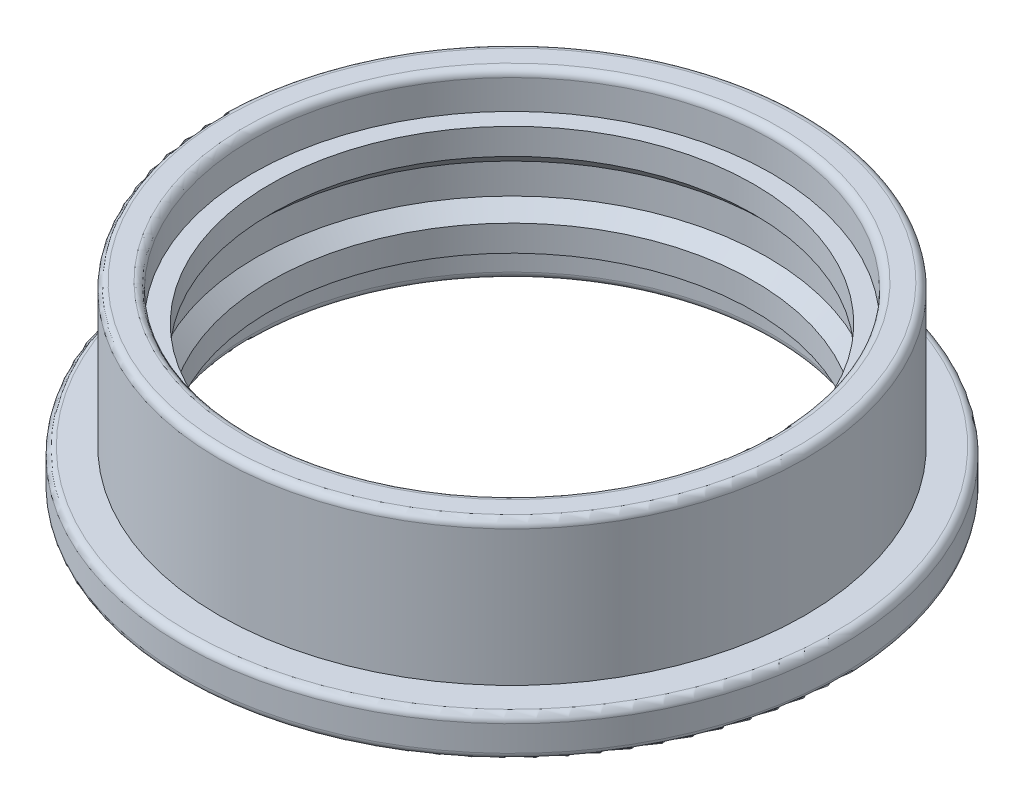
ISO-10303-21;
HEADER;
FILE_DESCRIPTION(('STEP AP214'),'2;1');
FILE_NAME('part.step','',(''),(''),'','','');
FILE_SCHEMA(('AUTOMOTIVE_DESIGN { 1 0 10303 214 1 1 1 1 }'));
ENDSEC;
DATA;
#1=APPLICATION_CONTEXT('core data for automotive mechanical design processes');
#2=APPLICATION_PROTOCOL_DEFINITION('international standard','automotive_design',2000,#1);
#3=PRODUCT_CONTEXT('',#1,'mechanical');
#4=PRODUCT('Part','Part','',(#3));
#5=PRODUCT_RELATED_PRODUCT_CATEGORY('part','',(#4));
#6=PRODUCT_DEFINITION_FORMATION('','',#4);
#7=PRODUCT_DEFINITION_CONTEXT('part definition',#1,'design');
#8=PRODUCT_DEFINITION('design','',#6,#7);
#9=PRODUCT_DEFINITION_SHAPE('','',#8);
#10=(LENGTH_UNIT() NAMED_UNIT(*) SI_UNIT(.MILLI.,.METRE.));
#11=(NAMED_UNIT(*) PLANE_ANGLE_UNIT() SI_UNIT($,.RADIAN.));
#12=(NAMED_UNIT(*) SI_UNIT($,.STERADIAN.) SOLID_ANGLE_UNIT());
#13=UNCERTAINTY_MEASURE_WITH_UNIT(LENGTH_MEASURE(1.E-05),#10,'distance_accuracy_value','');
#14=(GEOMETRIC_REPRESENTATION_CONTEXT(3) GLOBAL_UNCERTAINTY_ASSIGNED_CONTEXT((#13)) GLOBAL_UNIT_ASSIGNED_CONTEXT((#10,
#11,#12)) REPRESENTATION_CONTEXT('',''));
#15=CARTESIAN_POINT('',(0.,0.,0.));
#16=DIRECTION('',(0.,0.,1.));
#17=DIRECTION('',(1.,0.,0.));
#18=AXIS2_PLACEMENT_3D('',#15,#16,#17);
#19=CARTESIAN_POINT('',(0.,5.,0.));
#20=DIRECTION('',(0.,-1.,0.));
#21=DIRECTION('',(0.,0.,-1.));
#22=AXIS2_PLACEMENT_3D('',#19,#20,#21);
#23=CYLINDRICAL_SURFACE('',#22,6.6);
#24=CARTESIAN_POINT('',(0.,4.,0.));
#25=DIRECTION('',(0.,1.,0.));
#26=DIRECTION('',(0.,0.,1.));
#27=AXIS2_PLACEMENT_3D('',#24,#25,#26);
#28=CIRCLE('',#27,6.6);
#29=CARTESIAN_POINT('',(0.,4.,6.6));
#30=VERTEX_POINT('',#29);
#31=EDGE_CURVE('E98',#30,#30,#28,.T.);
#32=ORIENTED_EDGE('',*,*,#31,.T.);
#33=EDGE_LOOP('',(#32));
#34=FACE_BOUND('',#33,.T.);
#35=CARTESIAN_POINT('',(0.,3.28921356237309,0.));
#36=DIRECTION('',(0.,-1.,0.));
#37=DIRECTION('',(0.,0.,-1.));
#38=AXIS2_PLACEMENT_3D('',#35,#36,#37);
#39=CIRCLE('',#38,6.6);
#40=CARTESIAN_POINT('',(0.,3.28921356237309,-6.6));
#41=VERTEX_POINT('',#40);
#42=EDGE_CURVE('E83',#41,#41,#39,.T.);
#43=ORIENTED_EDGE('',*,*,#42,.T.);
#44=EDGE_LOOP('',(#43));
#45=FACE_BOUND('',#44,.T.);
#46=ADVANCED_FACE('F34',(#34,#45),#23,.F.);
#47=CARTESIAN_POINT('',(0.,1.,0.));
#48=DIRECTION('',(0.,1.,0.));
#49=DIRECTION('',(0.,0.,1.));
#50=AXIS2_PLACEMENT_3D('',#47,#48,#49);
#51=CIRCLE('',#50,6.6);
#52=CARTESIAN_POINT('',(0.,1.,6.6));
#53=VERTEX_POINT('',#52);
#54=EDGE_CURVE('E93',#53,#53,#51,.T.);
#55=ORIENTED_EDGE('',*,*,#54,.F.);
#56=EDGE_LOOP('',(#55));
#57=FACE_BOUND('',#56,.T.);
#58=CARTESIAN_POINT('',(0.,1.71078643762691,0.));
#59=DIRECTION('',(0.,1.,0.));
#60=DIRECTION('',(0.,0.,1.));
#61=AXIS2_PLACEMENT_3D('',#58,#59,#60);
#62=CIRCLE('',#61,6.6);
#63=CARTESIAN_POINT('',(0.,1.71078643762691,6.6));
#64=VERTEX_POINT('',#63);
#65=EDGE_CURVE('E88',#64,#64,#62,.T.);
#66=ORIENTED_EDGE('',*,*,#65,.T.);
#67=EDGE_LOOP('',(#66));
#68=FACE_BOUND('',#67,.T.);
#69=ADVANCED_FACE('F137',(#57,#68),#23,.F.);
#70=CARTESIAN_POINT('',(0.,5.,0.));
#71=DIRECTION('',(0.,1.,0.));
#72=DIRECTION('',(0.,0.,1.));
#73=AXIS2_PLACEMENT_3D('',#70,#71,#72);
#74=PLANE('',#73);
#75=CARTESIAN_POINT('',(0.,5.,0.));
#76=DIRECTION('',(0.,1.,0.));
#77=DIRECTION('',(0.,0.,1.));
#78=AXIS2_PLACEMENT_3D('',#75,#76,#77);
#79=CIRCLE('',#78,7.8);
#80=CARTESIAN_POINT('',(0.,5.,7.8));
#81=VERTEX_POINT('',#80);
#82=EDGE_CURVE('E48',#81,#81,#79,.T.);
#83=ORIENTED_EDGE('',*,*,#82,.T.);
#84=EDGE_LOOP('',(#83));
#85=FACE_BOUND('',#84,.T.);
#86=CARTESIAN_POINT('',(0.,5.,0.));
#87=DIRECTION('',(0.,1.,0.));
#88=DIRECTION('',(0.,0.,1.));
#89=AXIS2_PLACEMENT_3D('',#86,#87,#88);
#90=CIRCLE('',#89,7.3);
#91=CARTESIAN_POINT('',(0.,5.,7.3));
#92=VERTEX_POINT('',#91);
#93=EDGE_CURVE('E53',#92,#92,#90,.F.);
#94=ORIENTED_EDGE('',*,*,#93,.T.);
#95=EDGE_LOOP('',(#94));
#96=FACE_BOUND('',#95,.T.);
#97=ADVANCED_FACE('F143',(#85,#96),#74,.T.);
#98=CARTESIAN_POINT('',(0.,5.,0.));
#99=DIRECTION('',(0.,-1.,0.));
#100=DIRECTION('',(0.,0.,-1.));
#101=AXIS2_PLACEMENT_3D('',#98,#99,#100);
#102=CYLINDRICAL_SURFACE('',#101,9.);
#103=CARTESIAN_POINT('',(0.,0.2,0.));
#104=DIRECTION('',(0.,1.,0.));
#105=DIRECTION('',(0.,0.,1.));
#106=AXIS2_PLACEMENT_3D('',#103,#104,#105);
#107=CIRCLE('',#106,9.);
#108=CARTESIAN_POINT('',(0.,0.2,9.));
#109=VERTEX_POINT('',#108);
#110=EDGE_CURVE('E62',#109,#109,#107,.T.);
#111=ORIENTED_EDGE('',*,*,#110,.T.);
#112=EDGE_LOOP('',(#111));
#113=FACE_BOUND('',#112,.T.);
#114=CARTESIAN_POINT('',(0.,0.900000000000001,0.));
#115=DIRECTION('',(0.,1.,0.));
#116=DIRECTION('',(0.,0.,1.));
#117=AXIS2_PLACEMENT_3D('',#114,#115,#116);
#118=CIRCLE('',#117,9.);
#119=CARTESIAN_POINT('',(0.,0.900000000000001,9.));
#120=VERTEX_POINT('',#119);
#121=EDGE_CURVE('E66',#120,#120,#118,.F.);
#122=ORIENTED_EDGE('',*,*,#121,.T.);
#123=EDGE_LOOP('',(#122));
#124=FACE_BOUND('',#123,.T.);
#125=ADVANCED_FACE('F152',(#113,#124),#102,.T.);
#126=CARTESIAN_POINT('',(0.,0.,0.));
#127=DIRECTION('',(0.,1.,0.));
#128=DIRECTION('',(0.,0.,1.));
#129=AXIS2_PLACEMENT_3D('',#126,#127,#128);
#130=PLANE('',#129);
#131=CARTESIAN_POINT('',(0.,0.,0.));
#132=DIRECTION('',(0.,1.,0.));
#133=DIRECTION('',(0.,0.,1.));
#134=AXIS2_PLACEMENT_3D('',#131,#132,#133);
#135=CIRCLE('',#134,7.3);
#136=CARTESIAN_POINT('',(0.,0.,7.3));
#137=VERTEX_POINT('',#136);
#138=EDGE_CURVE('E74',#137,#137,#135,.T.);
#139=ORIENTED_EDGE('',*,*,#138,.T.);
#140=EDGE_LOOP('',(#139));
#141=FACE_BOUND('',#140,.T.);
#142=CARTESIAN_POINT('',(0.,0.,0.));
#143=DIRECTION('',(0.,1.,0.));
#144=DIRECTION('',(0.,0.,1.));
#145=AXIS2_PLACEMENT_3D('',#142,#143,#144);
#146=CIRCLE('',#145,8.8);
#147=CARTESIAN_POINT('',(0.,0.,8.8));
#148=VERTEX_POINT('',#147);
#149=EDGE_CURVE('E78',#148,#148,#146,.F.);
#150=ORIENTED_EDGE('',*,*,#149,.T.);
#151=EDGE_LOOP('',(#150));
#152=FACE_BOUND('',#151,.T.);
#153=ADVANCED_FACE('F154',(#141,#152),#130,.F.);
#154=CARTESIAN_POINT('',(0.,1.1,0.));
#155=DIRECTION('',(0.,1.,0.));
#156=DIRECTION('',(0.,0.,1.));
#157=AXIS2_PLACEMENT_3D('',#154,#155,#156);
#158=PLANE('',#157);
#159=CARTESIAN_POINT('',(0.,1.1,0.));
#160=DIRECTION('',(0.,1.,0.));
#161=DIRECTION('',(0.,0.,1.));
#162=AXIS2_PLACEMENT_3D('',#159,#160,#161);
#163=CIRCLE('',#162,8.8);
#164=CARTESIAN_POINT('',(0.,1.1,8.8));
#165=VERTEX_POINT('',#164);
#166=EDGE_CURVE('E58',#165,#165,#163,.T.);
#167=ORIENTED_EDGE('',*,*,#166,.T.);
#168=EDGE_LOOP('',(#167));
#169=FACE_BOUND('',#168,.T.);
#170=CARTESIAN_POINT('',(0.,1.1,0.));
#171=DIRECTION('',(0.,1.,0.));
#172=DIRECTION('',(0.,0.,1.));
#173=AXIS2_PLACEMENT_3D('',#170,#171,#172);
#174=CIRCLE('',#173,8.);
#175=CARTESIAN_POINT('',(0.,1.1,8.));
#176=VERTEX_POINT('',#175);
#177=EDGE_CURVE('E82',#176,#176,#174,.T.);
#178=ORIENTED_EDGE('',*,*,#177,.F.);
#179=EDGE_LOOP('',(#178));
#180=FACE_BOUND('',#179,.T.);
#181=ADVANCED_FACE('F148',(#169,#180),#158,.T.);
#182=CARTESIAN_POINT('',(0.,1.1,0.));
#183=DIRECTION('',(0.,1.,0.));
#184=DIRECTION('',(0.,0.,1.));
#185=AXIS2_PLACEMENT_3D('',#182,#183,#184);
#186=CYLINDRICAL_SURFACE('',#185,8.);
#187=CARTESIAN_POINT('',(0.,4.8,0.));
#188=DIRECTION('',(0.,1.,0.));
#189=DIRECTION('',(0.,0.,1.));
#190=AXIS2_PLACEMENT_3D('',#187,#188,#189);
#191=CIRCLE('',#190,8.);
#192=CARTESIAN_POINT('',(0.,4.8,8.));
#193=VERTEX_POINT('',#192);
#194=EDGE_CURVE('E42',#193,#193,#191,.F.);
#195=ORIENTED_EDGE('',*,*,#194,.T.);
#196=EDGE_LOOP('',(#195));
#197=FACE_BOUND('',#196,.T.);
#198=ORIENTED_EDGE('',*,*,#177,.T.);
#199=EDGE_LOOP('',(#198));
#200=FACE_BOUND('',#199,.T.);
#201=ADVANCED_FACE('F236',(#197,#200),#186,.T.);
#202=CARTESIAN_POINT('',(0.,4.,0.));
#203=DIRECTION('',(0.,1.,0.));
#204=DIRECTION('',(0.,0.,1.));
#205=AXIS2_PLACEMENT_3D('',#202,#203,#204);
#206=CYLINDRICAL_SURFACE('',#205,7.1);
#207=CARTESIAN_POINT('',(0.,4.8,0.));
#208=DIRECTION('',(0.,1.,0.));
#209=DIRECTION('',(0.,0.,1.));
#210=AXIS2_PLACEMENT_3D('',#207,#208,#209);
#211=CIRCLE('',#210,7.1);
#212=CARTESIAN_POINT('',(0.,4.8,7.1));
#213=VERTEX_POINT('',#212);
#214=EDGE_CURVE('E10',#213,#213,#211,.T.);
#215=ORIENTED_EDGE('',*,*,#214,.T.);
#216=EDGE_LOOP('',(#215));
#217=FACE_BOUND('',#216,.T.);
#218=CARTESIAN_POINT('',(0.,4.,0.));
#219=DIRECTION('',(0.,1.,0.));
#220=DIRECTION('',(0.,0.,1.));
#221=AXIS2_PLACEMENT_3D('',#218,#219,#220);
#222=CIRCLE('',#221,7.1);
#223=CARTESIAN_POINT('',(0.,4.,7.1));
#224=VERTEX_POINT('',#223);
#225=EDGE_CURVE('E97',#224,#224,#222,.T.);
#226=ORIENTED_EDGE('',*,*,#225,.F.);
#227=EDGE_LOOP('',(#226));
#228=FACE_BOUND('',#227,.T.);
#229=ADVANCED_FACE('F230',(#217,#228),#206,.F.);
#230=CARTESIAN_POINT('',(0.,4.,0.));
#231=DIRECTION('',(0.,1.,0.));
#232=DIRECTION('',(0.,0.,1.));
#233=AXIS2_PLACEMENT_3D('',#230,#231,#232);
#234=PLANE('',#233);
#235=ORIENTED_EDGE('',*,*,#31,.F.);
#236=EDGE_LOOP('',(#235));
#237=FACE_BOUND('',#236,.T.);
#238=ORIENTED_EDGE('',*,*,#225,.T.);
#239=EDGE_LOOP('',(#238));
#240=FACE_BOUND('',#239,.T.);
#241=ADVANCED_FACE('F221',(#237,#240),#234,.T.);
#242=CARTESIAN_POINT('',(0.,0.,0.));
#243=DIRECTION('',(0.,1.,0.));
#244=DIRECTION('',(0.,0.,1.));
#245=AXIS2_PLACEMENT_3D('',#242,#243,#244);
#246=CYLINDRICAL_SURFACE('',#245,7.1);
#247=CARTESIAN_POINT('',(0.,0.2,0.));
#248=DIRECTION('',(0.,1.,0.));
#249=DIRECTION('',(0.,0.,1.));
#250=AXIS2_PLACEMENT_3D('',#247,#248,#249);
#251=CIRCLE('',#250,7.1);
#252=CARTESIAN_POINT('',(0.,0.2,7.1));
#253=VERTEX_POINT('',#252);
#254=EDGE_CURVE('E70',#253,#253,#251,.F.);
#255=ORIENTED_EDGE('',*,*,#254,.T.);
#256=EDGE_LOOP('',(#255));
#257=FACE_BOUND('',#256,.T.);
#258=CARTESIAN_POINT('',(0.,1.,0.));
#259=DIRECTION('',(0.,1.,0.));
#260=DIRECTION('',(0.,0.,1.));
#261=AXIS2_PLACEMENT_3D('',#258,#259,#260);
#262=CIRCLE('',#261,7.1);
#263=CARTESIAN_POINT('',(0.,1.,7.1));
#264=VERTEX_POINT('',#263);
#265=EDGE_CURVE('E87',#264,#264,#262,.T.);
#266=ORIENTED_EDGE('',*,*,#265,.T.);
#267=EDGE_LOOP('',(#266));
#268=FACE_BOUND('',#267,.T.);
#269=ADVANCED_FACE('F214',(#257,#268),#246,.F.);
#270=CARTESIAN_POINT('',(0.,1.,0.));
#271=DIRECTION('',(0.,1.,0.));
#272=DIRECTION('',(0.,0.,1.));
#273=AXIS2_PLACEMENT_3D('',#270,#271,#272);
#274=PLANE('',#273);
#275=ORIENTED_EDGE('',*,*,#54,.T.);
#276=EDGE_LOOP('',(#275));
#277=FACE_BOUND('',#276,.T.);
#278=ORIENTED_EDGE('',*,*,#265,.F.);
#279=EDGE_LOOP('',(#278));
#280=FACE_BOUND('',#279,.T.);
#281=ADVANCED_FACE('F220',(#277,#280),#274,.F.);
#282=CARTESIAN_POINT('',(0.,4.,0.));
#283=DIRECTION('',(0.,-1.,0.));
#284=DIRECTION('',(0.,0.,-1.));
#285=AXIS2_PLACEMENT_3D('',#282,#283,#284);
#286=CONICAL_SURFACE('',#285,5.8892135623731,0.785398163397448);
#287=ORIENTED_EDGE('',*,*,#42,.F.);
#288=EDGE_LOOP('',(#287));
#289=FACE_BOUND('',#288,.T.);
#290=CARTESIAN_POINT('',(0.,2.91421356237309,0.));
#291=DIRECTION('',(0.,-1.,0.));
#292=DIRECTION('',(0.,0.,-1.));
#293=AXIS2_PLACEMENT_3D('',#290,#291,#292);
#294=CIRCLE('',#293,6.975);
#295=CARTESIAN_POINT('',(0.,2.91421356237309,-6.975));
#296=VERTEX_POINT('',#295);
#297=EDGE_CURVE('E114',#296,#296,#294,.T.);
#298=ORIENTED_EDGE('',*,*,#297,.T.);
#299=EDGE_LOOP('',(#298));
#300=FACE_BOUND('',#299,.T.);
#301=ADVANCED_FACE('F119',(#289,#300),#286,.F.);
#302=CARTESIAN_POINT('',(0.,2.08578643762691,0.));
#303=DIRECTION('',(0.,1.,0.));
#304=DIRECTION('',(0.,0.,1.));
#305=AXIS2_PLACEMENT_3D('',#302,#303,#304);
#306=CONICAL_SURFACE('',#305,6.975,0.785398163397448);
#307=ORIENTED_EDGE('',*,*,#65,.F.);
#308=EDGE_LOOP('',(#307));
#309=FACE_BOUND('',#308,.T.);
#310=CARTESIAN_POINT('',(0.,2.08578643762691,0.));
#311=DIRECTION('',(0.,-1.,0.));
#312=DIRECTION('',(0.,0.,-1.));
#313=AXIS2_PLACEMENT_3D('',#310,#311,#312);
#314=CIRCLE('',#313,6.975);
#315=CARTESIAN_POINT('',(0.,2.08578643762691,-6.975));
#316=VERTEX_POINT('',#315);
#317=EDGE_CURVE('E92',#316,#316,#314,.T.);
#318=ORIENTED_EDGE('',*,*,#317,.F.);
#319=EDGE_LOOP('',(#318));
#320=FACE_BOUND('',#319,.T.);
#321=ADVANCED_FACE('F124',(#309,#320),#306,.F.);
#322=CARTESIAN_POINT('',(0.,0.,0.));
#323=DIRECTION('',(0.,-1.,0.));
#324=DIRECTION('',(0.,0.,-1.));
#325=AXIS2_PLACEMENT_3D('',#322,#323,#324);
#326=CYLINDRICAL_SURFACE('',#325,6.975);
#327=ORIENTED_EDGE('',*,*,#317,.T.);
#328=EDGE_LOOP('',(#327));
#329=FACE_BOUND('',#328,.T.);
#330=ORIENTED_EDGE('',*,*,#297,.F.);
#331=EDGE_LOOP('',(#330));
#332=FACE_BOUND('',#331,.T.);
#333=ADVANCED_FACE('F121',(#329,#332),#326,.F.);
#334=CARTESIAN_POINT('',(0.,0.2,0.));
#335=DIRECTION('',(0.,1.,0.));
#336=DIRECTION('',(0.,0.,1.));
#337=AXIS2_PLACEMENT_3D('',#334,#335,#336);
#338=TOROIDAL_SURFACE('',#337,7.3,0.2);
#339=ORIENTED_EDGE('',*,*,#254,.F.);
#340=EDGE_LOOP('',(#339));
#341=FACE_BOUND('',#340,.T.);
#342=ORIENTED_EDGE('',*,*,#138,.F.);
#343=EDGE_LOOP('',(#342));
#344=FACE_BOUND('',#343,.T.);
#345=ADVANCED_FACE('F123',(#341,#344),#338,.T.);
#346=CARTESIAN_POINT('',(0.,0.2,0.));
#347=DIRECTION('',(0.,1.,0.));
#348=DIRECTION('',(0.,0.,1.));
#349=AXIS2_PLACEMENT_3D('',#346,#347,#348);
#350=TOROIDAL_SURFACE('',#349,8.8,0.2);
#351=ORIENTED_EDGE('',*,*,#149,.F.);
#352=EDGE_LOOP('',(#351));
#353=FACE_BOUND('',#352,.T.);
#354=ORIENTED_EDGE('',*,*,#110,.F.);
#355=EDGE_LOOP('',(#354));
#356=FACE_BOUND('',#355,.T.);
#357=ADVANCED_FACE('F131',(#353,#356),#350,.T.);
#358=CARTESIAN_POINT('',(0.,0.900000000000001,0.));
#359=DIRECTION('',(0.,1.,0.));
#360=DIRECTION('',(0.,0.,1.));
#361=AXIS2_PLACEMENT_3D('',#358,#359,#360);
#362=TOROIDAL_SURFACE('',#361,8.8,0.2);
#363=ORIENTED_EDGE('',*,*,#121,.F.);
#364=EDGE_LOOP('',(#363));
#365=FACE_BOUND('',#364,.T.);
#366=ORIENTED_EDGE('',*,*,#166,.F.);
#367=EDGE_LOOP('',(#366));
#368=FACE_BOUND('',#367,.T.);
#369=ADVANCED_FACE('F163',(#365,#368),#362,.T.);
#370=CARTESIAN_POINT('',(0.,4.8,0.));
#371=DIRECTION('',(0.,1.,0.));
#372=DIRECTION('',(0.,0.,1.));
#373=AXIS2_PLACEMENT_3D('',#370,#371,#372);
#374=TOROIDAL_SURFACE('',#373,7.8,0.2);
#375=ORIENTED_EDGE('',*,*,#194,.F.);
#376=EDGE_LOOP('',(#375));
#377=FACE_BOUND('',#376,.T.);
#378=ORIENTED_EDGE('',*,*,#82,.F.);
#379=EDGE_LOOP('',(#378));
#380=FACE_BOUND('',#379,.T.);
#381=ADVANCED_FACE('F166',(#377,#380),#374,.T.);
#382=CARTESIAN_POINT('',(0.,4.8,0.));
#383=DIRECTION('',(0.,1.,0.));
#384=DIRECTION('',(0.,0.,1.));
#385=AXIS2_PLACEMENT_3D('',#382,#383,#384);
#386=TOROIDAL_SURFACE('',#385,7.3,0.2);
#387=ORIENTED_EDGE('',*,*,#93,.F.);
#388=EDGE_LOOP('',(#387));
#389=FACE_BOUND('',#388,.T.);
#390=ORIENTED_EDGE('',*,*,#214,.F.);
#391=EDGE_LOOP('',(#390));
#392=FACE_BOUND('',#391,.T.);
#393=ADVANCED_FACE('F36',(#389,#392),#386,.T.);
#394=CLOSED_SHELL('',(#46,#69,#97,#125,#153,#181,#201,#229,#241,#269,#281,#301,#321,#333,#345,
#357,#369,#381,#393));
#395=MANIFOLD_SOLID_BREP('B2',#394);
#396=ADVANCED_BREP_SHAPE_REPRESENTATION('',(#18,#395),#14);
#397=SHAPE_DEFINITION_REPRESENTATION(#9,#396);
ENDSEC;
END-ISO-10303-21;
